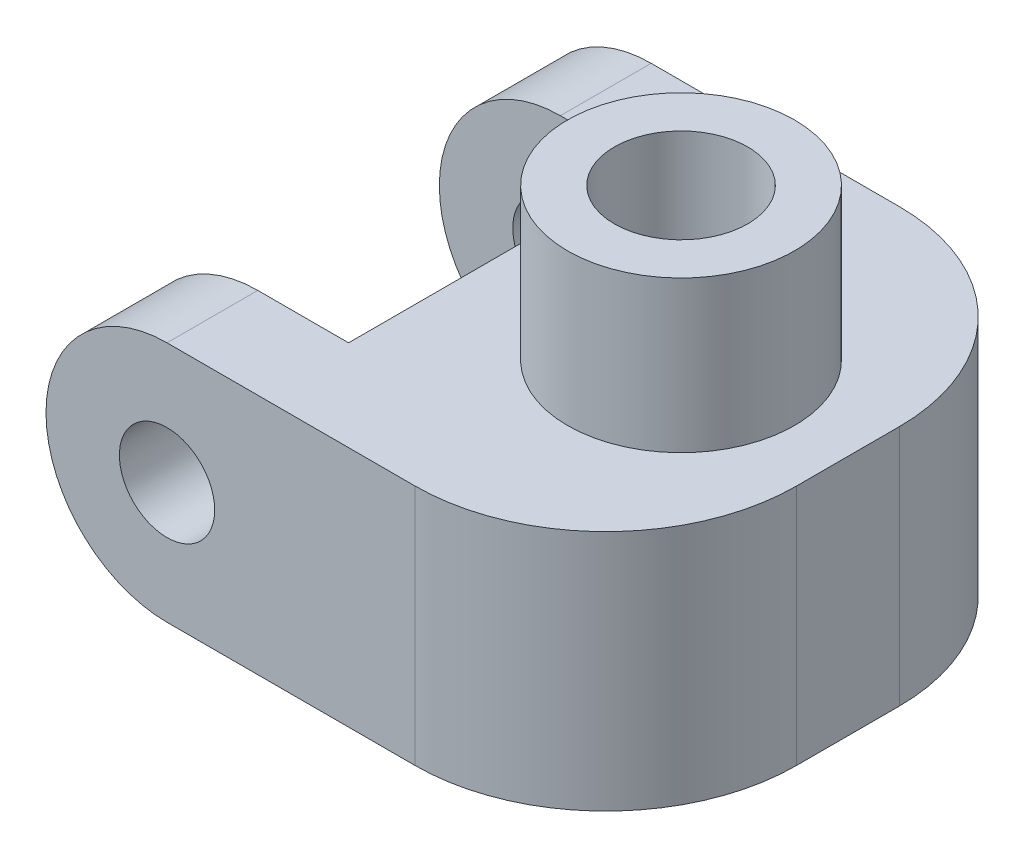
ISO-10303-21;
HEADER;
FILE_DESCRIPTION(('STEP AP214'),'2;1');
FILE_NAME('part.step','',(''),(''),'','','');
FILE_SCHEMA(('AUTOMOTIVE_DESIGN { 1 0 10303 214 1 1 1 1 }'));
ENDSEC;
DATA;
#1=APPLICATION_CONTEXT('core data for automotive mechanical design processes');
#2=APPLICATION_PROTOCOL_DEFINITION('international standard','automotive_design',2000,#1);
#3=PRODUCT_CONTEXT('',#1,'mechanical');
#4=PRODUCT('Part','Part','',(#3));
#5=PRODUCT_RELATED_PRODUCT_CATEGORY('part','',(#4));
#6=PRODUCT_DEFINITION_FORMATION('','',#4);
#7=PRODUCT_DEFINITION_CONTEXT('part definition',#1,'design');
#8=PRODUCT_DEFINITION('design','',#6,#7);
#9=PRODUCT_DEFINITION_SHAPE('','',#8);
#10=(LENGTH_UNIT() NAMED_UNIT(*) SI_UNIT(.MILLI.,.METRE.));
#11=(NAMED_UNIT(*) PLANE_ANGLE_UNIT() SI_UNIT($,.RADIAN.));
#12=(NAMED_UNIT(*) SI_UNIT($,.STERADIAN.) SOLID_ANGLE_UNIT());
#13=UNCERTAINTY_MEASURE_WITH_UNIT(LENGTH_MEASURE(1.E-05),#10,'distance_accuracy_value','');
#14=(GEOMETRIC_REPRESENTATION_CONTEXT(3) GLOBAL_UNCERTAINTY_ASSIGNED_CONTEXT((#13)) GLOBAL_UNIT_ASSIGNED_CONTEXT((#10,
#11,#12)) REPRESENTATION_CONTEXT('',''));
#15=CARTESIAN_POINT('',(0.,0.,0.));
#16=DIRECTION('',(0.,0.,1.));
#17=DIRECTION('',(1.,0.,0.));
#18=AXIS2_PLACEMENT_3D('',#15,#16,#17);
#19=CARTESIAN_POINT('',(0.,-5.08,20.32));
#20=DIRECTION('',(0.,-1.,0.));
#21=DIRECTION('',(0.,0.,-1.));
#22=AXIS2_PLACEMENT_3D('',#19,#20,#21);
#23=PLANE('',#22);
#24=DIRECTION('',(0.,0.,-1.));
#25=VECTOR('',#24,1.);
#26=CARTESIAN_POINT('',(18.415,-5.08,20.32));
#27=LINE('',#26,#25);
#28=CARTESIAN_POINT('',(18.415,-5.08,12.32));
#29=VERTEX_POINT('',#28);
#30=CARTESIAN_POINT('',(18.415,-5.08,8.));
#31=VERTEX_POINT('',#30);
#32=EDGE_CURVE('E188',#29,#31,#27,.T.);
#33=ORIENTED_EDGE('',*,*,#32,.F.);
#34=CARTESIAN_POINT('',(10.415,-5.08,12.32));
#35=DIRECTION('',(0.,-1.,0.));
#36=DIRECTION('',(0.,0.,-1.));
#37=AXIS2_PLACEMENT_3D('',#34,#35,#36);
#38=CIRCLE('',#37,8.);
#39=CARTESIAN_POINT('',(10.415,-5.08,20.32));
#40=VERTEX_POINT('',#39);
#41=EDGE_CURVE('E51',#29,#40,#38,.T.);
#42=ORIENTED_EDGE('',*,*,#41,.T.);
#43=DIRECTION('',(-1.,0.,0.));
#44=VECTOR('',#43,1.);
#45=CARTESIAN_POINT('',(0.,-5.08,20.32));
#46=LINE('',#45,#44);
#47=CARTESIAN_POINT('',(0.,-5.08,20.32));
#48=VERTEX_POINT('',#47);
#49=EDGE_CURVE('E173',#40,#48,#46,.T.);
#50=ORIENTED_EDGE('',*,*,#49,.T.);
#51=DIRECTION('',(0.,0.,-1.));
#52=VECTOR('',#51,1.);
#53=CARTESIAN_POINT('',(0.,-5.08,20.32));
#54=LINE('',#53,#52);
#55=CARTESIAN_POINT('',(0.,-5.08,16.51));
#56=VERTEX_POINT('',#55);
#57=EDGE_CURVE('E195',#48,#56,#54,.T.);
#58=ORIENTED_EDGE('',*,*,#57,.T.);
#59=DIRECTION('',(-1.,0.,0.));
#60=VECTOR('',#59,1.);
#61=CARTESIAN_POINT('',(0.,-5.08,16.51));
#62=LINE('',#61,#60);
#63=CARTESIAN_POINT('',(11.4300000000001,-5.08,16.51));
#64=VERTEX_POINT('',#63);
#65=EDGE_CURVE('E171',#64,#56,#62,.T.);
#66=ORIENTED_EDGE('',*,*,#65,.F.);
#67=DIRECTION('',(0.,0.,-1.));
#68=VECTOR('',#67,1.);
#69=CARTESIAN_POINT('',(11.4300000000001,-5.08,20.32));
#70=LINE('',#69,#68);
#71=CARTESIAN_POINT('',(11.4300000000001,-5.08,3.81));
#72=VERTEX_POINT('',#71);
#73=EDGE_CURVE('E206',#64,#72,#70,.T.);
#74=ORIENTED_EDGE('',*,*,#73,.T.);
#75=DIRECTION('',(-1.,0.,0.));
#76=VECTOR('',#75,1.);
#77=CARTESIAN_POINT('',(0.,-5.08,3.81));
#78=LINE('',#77,#76);
#79=CARTESIAN_POINT('',(0.,-5.08,3.81));
#80=VERTEX_POINT('',#79);
#81=EDGE_CURVE('E139',#72,#80,#78,.T.);
#82=ORIENTED_EDGE('',*,*,#81,.T.);
#83=CARTESIAN_POINT('',(0.,-5.08,0.));
#84=VERTEX_POINT('',#83);
#85=EDGE_CURVE('E184',#80,#84,#54,.T.);
#86=ORIENTED_EDGE('',*,*,#85,.T.);
#87=DIRECTION('',(-1.,0.,0.));
#88=VECTOR('',#87,1.);
#89=CARTESIAN_POINT('',(0.,-5.08,0.));
#90=LINE('',#89,#88);
#91=CARTESIAN_POINT('',(10.415,-5.08,0.));
#92=VERTEX_POINT('',#91);
#93=EDGE_CURVE('E185',#92,#84,#90,.T.);
#94=ORIENTED_EDGE('',*,*,#93,.F.);
#95=CARTESIAN_POINT('',(10.415,-5.08,8.));
#96=DIRECTION('',(0.,-1.,0.));
#97=DIRECTION('',(0.,0.,-1.));
#98=AXIS2_PLACEMENT_3D('',#95,#96,#97);
#99=CIRCLE('',#98,8.);
#100=EDGE_CURVE('E63',#92,#31,#99,.T.);
#101=ORIENTED_EDGE('',*,*,#100,.T.);
#102=EDGE_LOOP('',(#33,#42,#50,#58,#66,#74,#82,#86,#94,#101));
#103=FACE_BOUND('',#102,.T.);
#104=ADVANCED_FACE('F43',(#103),#23,.T.);
#105=CARTESIAN_POINT('',(0.,5.08,20.32));
#106=DIRECTION('',(0.,1.,0.));
#107=DIRECTION('',(0.,0.,1.));
#108=AXIS2_PLACEMENT_3D('',#105,#106,#107);
#109=PLANE('',#108);
#110=CARTESIAN_POINT('',(11.415,5.08,10.16));
#111=DIRECTION('',(0.,1.,0.));
#112=DIRECTION('',(0.,0.,1.));
#113=AXIS2_PLACEMENT_3D('',#110,#111,#112);
#114=CIRCLE('',#113,4.76250000000001);
#115=CARTESIAN_POINT('',(11.415,5.08,14.9225));
#116=VERTEX_POINT('',#115);
#117=EDGE_CURVE('E486',#116,#116,#114,.T.);
#118=ORIENTED_EDGE('',*,*,#117,.F.);
#119=EDGE_LOOP('',(#118));
#120=FACE_BOUND('',#119,.T.);
#121=DIRECTION('',(1.,0.,0.));
#122=VECTOR('',#121,1.);
#123=CARTESIAN_POINT('',(0.,5.08,20.32));
#124=LINE('',#123,#122);
#125=CARTESIAN_POINT('',(0.,5.08,20.32));
#126=VERTEX_POINT('',#125);
#127=CARTESIAN_POINT('',(10.415,5.08,20.32));
#128=VERTEX_POINT('',#127);
#129=EDGE_CURVE('E175',#126,#128,#124,.T.);
#130=ORIENTED_EDGE('',*,*,#129,.T.);
#131=CARTESIAN_POINT('',(10.415,5.08,12.32));
#132=DIRECTION('',(0.,1.,0.));
#133=DIRECTION('',(0.,0.,1.));
#134=AXIS2_PLACEMENT_3D('',#131,#132,#133);
#135=CIRCLE('',#134,8.);
#136=CARTESIAN_POINT('',(18.415,5.08,12.32));
#137=VERTEX_POINT('',#136);
#138=EDGE_CURVE('E218',#128,#137,#135,.T.);
#139=ORIENTED_EDGE('',*,*,#138,.T.);
#140=DIRECTION('',(0.,0.,-1.));
#141=VECTOR('',#140,1.);
#142=CARTESIAN_POINT('',(18.415,5.08,20.32));
#143=LINE('',#142,#141);
#144=CARTESIAN_POINT('',(18.415,5.08,8.));
#145=VERTEX_POINT('',#144);
#146=EDGE_CURVE('E138',#137,#145,#143,.T.);
#147=ORIENTED_EDGE('',*,*,#146,.T.);
#148=CARTESIAN_POINT('',(10.415,5.08,8.));
#149=DIRECTION('',(0.,1.,0.));
#150=DIRECTION('',(0.,0.,1.));
#151=AXIS2_PLACEMENT_3D('',#148,#149,#150);
#152=CIRCLE('',#151,8.);
#153=CARTESIAN_POINT('',(10.415,5.08,0.));
#154=VERTEX_POINT('',#153);
#155=EDGE_CURVE('E216',#145,#154,#152,.T.);
#156=ORIENTED_EDGE('',*,*,#155,.T.);
#157=DIRECTION('',(1.,0.,0.));
#158=VECTOR('',#157,1.);
#159=CARTESIAN_POINT('',(0.,5.08,0.));
#160=LINE('',#159,#158);
#161=CARTESIAN_POINT('',(0.,5.08,0.));
#162=VERTEX_POINT('',#161);
#163=EDGE_CURVE('E187',#162,#154,#160,.T.);
#164=ORIENTED_EDGE('',*,*,#163,.F.);
#165=DIRECTION('',(0.,0.,-1.));
#166=VECTOR('',#165,1.);
#167=CARTESIAN_POINT('',(0.,5.08,20.32));
#168=LINE('',#167,#166);
#169=CARTESIAN_POINT('',(0.,5.08,3.81));
#170=VERTEX_POINT('',#169);
#171=EDGE_CURVE('E153',#170,#162,#168,.T.);
#172=ORIENTED_EDGE('',*,*,#171,.F.);
#173=DIRECTION('',(1.,0.,0.));
#174=VECTOR('',#173,1.);
#175=CARTESIAN_POINT('',(0.,5.08,3.81));
#176=LINE('',#175,#174);
#177=CARTESIAN_POINT('',(3.81,5.08,3.81));
#178=VERTEX_POINT('',#177);
#179=EDGE_CURVE('E143',#170,#178,#176,.T.);
#180=ORIENTED_EDGE('',*,*,#179,.T.);
#181=DIRECTION('',(0.,0.,1.));
#182=VECTOR('',#181,1.);
#183=CARTESIAN_POINT('',(3.81,5.08,3.81));
#184=LINE('',#183,#182);
#185=CARTESIAN_POINT('',(3.81,5.08,16.51));
#186=VERTEX_POINT('',#185);
#187=EDGE_CURVE('E127',#178,#186,#184,.T.);
#188=ORIENTED_EDGE('',*,*,#187,.T.);
#189=DIRECTION('',(1.,0.,0.));
#190=VECTOR('',#189,1.);
#191=CARTESIAN_POINT('',(0.,5.08,16.51));
#192=LINE('',#191,#190);
#193=CARTESIAN_POINT('',(0.,5.08,16.51));
#194=VERTEX_POINT('',#193);
#195=EDGE_CURVE('E166',#194,#186,#192,.T.);
#196=ORIENTED_EDGE('',*,*,#195,.F.);
#197=EDGE_CURVE('E198',#126,#194,#168,.T.);
#198=ORIENTED_EDGE('',*,*,#197,.F.);
#199=EDGE_LOOP('',(#130,#139,#147,#156,#164,#172,#180,#188,#196,#198));
#200=FACE_BOUND('',#199,.T.);
#201=ADVANCED_FACE('F151',(#120,#200),#109,.T.);
#202=CARTESIAN_POINT('',(0.,0.,20.32));
#203=DIRECTION('',(0.,0.,-1.));
#204=DIRECTION('',(-1.,0.,0.));
#205=AXIS2_PLACEMENT_3D('',#202,#203,#204);
#206=CYLINDRICAL_SURFACE('',#205,5.08);
#207=CARTESIAN_POINT('',(0.,0.,3.81));
#208=DIRECTION('',(0.,0.,1.));
#209=DIRECTION('',(1.,0.,0.));
#210=AXIS2_PLACEMENT_3D('',#207,#208,#209);
#211=CIRCLE('',#210,5.08);
#212=EDGE_CURVE('E154',#170,#80,#211,.T.);
#213=ORIENTED_EDGE('',*,*,#212,.F.);
#214=ORIENTED_EDGE('',*,*,#171,.T.);
#215=CARTESIAN_POINT('',(0.,0.,0.));
#216=DIRECTION('',(0.,0.,1.));
#217=DIRECTION('',(1.,0.,0.));
#218=AXIS2_PLACEMENT_3D('',#215,#216,#217);
#219=CIRCLE('',#218,5.08);
#220=EDGE_CURVE('E190',#162,#84,#219,.T.);
#221=ORIENTED_EDGE('',*,*,#220,.T.);
#222=ORIENTED_EDGE('',*,*,#85,.F.);
#223=EDGE_LOOP('',(#213,#214,#221,#222));
#224=FACE_BOUND('',#223,.T.);
#225=ADVANCED_FACE('F248',(#224),#206,.T.);
#226=CARTESIAN_POINT('',(0.,0.,20.32));
#227=DIRECTION('',(0.,0.,-1.));
#228=DIRECTION('',(-1.,0.,0.));
#229=AXIS2_PLACEMENT_3D('',#226,#227,#228);
#230=CYLINDRICAL_SURFACE('',#229,2.);
#231=CARTESIAN_POINT('',(0.,0.,0.));
#232=DIRECTION('',(0.,0.,1.));
#233=DIRECTION('',(1.,0.,0.));
#234=AXIS2_PLACEMENT_3D('',#231,#232,#233);
#235=CIRCLE('',#234,2.);
#236=CARTESIAN_POINT('',(2.,0.,0.));
#237=VERTEX_POINT('',#236);
#238=EDGE_CURVE('E176',#237,#237,#235,.T.);
#239=ORIENTED_EDGE('',*,*,#238,.F.);
#240=EDGE_LOOP('',(#239));
#241=FACE_BOUND('',#240,.T.);
#242=CARTESIAN_POINT('',(0.,0.,3.81));
#243=DIRECTION('',(0.,0.,1.));
#244=DIRECTION('',(1.,0.,0.));
#245=AXIS2_PLACEMENT_3D('',#242,#243,#244);
#246=CIRCLE('',#245,2.);
#247=CARTESIAN_POINT('',(2.,0.,3.81));
#248=VERTEX_POINT('',#247);
#249=EDGE_CURVE('E147',#248,#248,#246,.T.);
#250=ORIENTED_EDGE('',*,*,#249,.T.);
#251=EDGE_LOOP('',(#250));
#252=FACE_BOUND('',#251,.T.);
#253=ADVANCED_FACE('F258',(#241,#252),#230,.F.);
#254=ORIENTED_EDGE('',*,*,#197,.T.);
#255=CARTESIAN_POINT('',(0.,0.,16.51));
#256=DIRECTION('',(0.,0.,1.));
#257=DIRECTION('',(1.,0.,0.));
#258=AXIS2_PLACEMENT_3D('',#255,#256,#257);
#259=CIRCLE('',#258,5.08);
#260=EDGE_CURVE('E168',#194,#56,#259,.T.);
#261=ORIENTED_EDGE('',*,*,#260,.T.);
#262=ORIENTED_EDGE('',*,*,#57,.F.);
#263=CARTESIAN_POINT('',(0.,0.,20.32));
#264=DIRECTION('',(0.,0.,1.));
#265=DIRECTION('',(1.,0.,0.));
#266=AXIS2_PLACEMENT_3D('',#263,#264,#265);
#267=CIRCLE('',#266,5.08);
#268=EDGE_CURVE('E178',#126,#48,#267,.T.);
#269=ORIENTED_EDGE('',*,*,#268,.F.);
#270=EDGE_LOOP('',(#254,#261,#262,#269));
#271=FACE_BOUND('',#270,.T.);
#272=ADVANCED_FACE('F255',(#271),#206,.T.);
#273=CARTESIAN_POINT('',(0.,0.,16.51));
#274=DIRECTION('',(0.,0.,1.));
#275=DIRECTION('',(1.,0.,0.));
#276=AXIS2_PLACEMENT_3D('',#273,#274,#275);
#277=CIRCLE('',#276,2.);
#278=CARTESIAN_POINT('',(2.,0.,16.51));
#279=VERTEX_POINT('',#278);
#280=EDGE_CURVE('E161',#279,#279,#277,.T.);
#281=ORIENTED_EDGE('',*,*,#280,.F.);
#282=EDGE_LOOP('',(#281));
#283=FACE_BOUND('',#282,.T.);
#284=CARTESIAN_POINT('',(0.,0.,20.32));
#285=DIRECTION('',(0.,0.,1.));
#286=DIRECTION('',(1.,0.,0.));
#287=AXIS2_PLACEMENT_3D('',#284,#285,#286);
#288=CIRCLE('',#287,2.);
#289=CARTESIAN_POINT('',(2.,0.,20.32));
#290=VERTEX_POINT('',#289);
#291=EDGE_CURVE('E181',#290,#290,#288,.T.);
#292=ORIENTED_EDGE('',*,*,#291,.T.);
#293=EDGE_LOOP('',(#292));
#294=FACE_BOUND('',#293,.T.);
#295=ADVANCED_FACE('F257',(#283,#294),#230,.F.);
#296=CARTESIAN_POINT('',(0.,0.,20.32));
#297=DIRECTION('',(0.,0.,1.));
#298=DIRECTION('',(1.,0.,0.));
#299=AXIS2_PLACEMENT_3D('',#296,#297,#298);
#300=PLANE('',#299);
#301=ORIENTED_EDGE('',*,*,#49,.F.);
#302=DIRECTION('',(0.,1.,0.));
#303=VECTOR('',#302,1.);
#304=CARTESIAN_POINT('',(10.415,5.08,20.32));
#305=LINE('',#304,#303);
#306=EDGE_CURVE('E213',#40,#128,#305,.T.);
#307=ORIENTED_EDGE('',*,*,#306,.T.);
#308=ORIENTED_EDGE('',*,*,#129,.F.);
#309=ORIENTED_EDGE('',*,*,#268,.T.);
#310=EDGE_LOOP('',(#301,#307,#308,#309));
#311=FACE_BOUND('',#310,.T.);
#312=ORIENTED_EDGE('',*,*,#291,.F.);
#313=EDGE_LOOP('',(#312));
#314=FACE_BOUND('',#313,.T.);
#315=ADVANCED_FACE('F231',(#311,#314),#300,.T.);
#316=CARTESIAN_POINT('',(0.,0.,0.));
#317=DIRECTION('',(0.,0.,1.));
#318=DIRECTION('',(1.,0.,0.));
#319=AXIS2_PLACEMENT_3D('',#316,#317,#318);
#320=PLANE('',#319);
#321=ORIENTED_EDGE('',*,*,#163,.T.);
#322=DIRECTION('',(0.,1.,0.));
#323=VECTOR('',#322,1.);
#324=CARTESIAN_POINT('',(10.415,0.,0.));
#325=LINE('',#324,#323);
#326=EDGE_CURVE('E11',#154,#92,#325,.F.);
#327=ORIENTED_EDGE('',*,*,#326,.T.);
#328=ORIENTED_EDGE('',*,*,#93,.T.);
#329=ORIENTED_EDGE('',*,*,#220,.F.);
#330=EDGE_LOOP('',(#321,#327,#328,#329));
#331=FACE_BOUND('',#330,.T.);
#332=ORIENTED_EDGE('',*,*,#238,.T.);
#333=EDGE_LOOP('',(#332));
#334=FACE_BOUND('',#333,.T.);
#335=ADVANCED_FACE('F243',(#331,#334),#320,.F.);
#336=CARTESIAN_POINT('',(18.415,-5.08,20.32));
#337=DIRECTION('',(-1.,0.,0.));
#338=DIRECTION('',(0.,0.,1.));
#339=AXIS2_PLACEMENT_3D('',#336,#337,#338);
#340=PLANE('',#339);
#341=ORIENTED_EDGE('',*,*,#146,.F.);
#342=DIRECTION('',(0.,1.,0.));
#343=VECTOR('',#342,1.);
#344=CARTESIAN_POINT('',(18.415,-5.08,12.32));
#345=LINE('',#344,#343);
#346=EDGE_CURVE('E223',#137,#29,#345,.F.);
#347=ORIENTED_EDGE('',*,*,#346,.T.);
#348=ORIENTED_EDGE('',*,*,#32,.T.);
#349=DIRECTION('',(0.,1.,0.));
#350=VECTOR('',#349,1.);
#351=CARTESIAN_POINT('',(18.415,-5.08,8.));
#352=LINE('',#351,#350);
#353=EDGE_CURVE('E220',#31,#145,#352,.T.);
#354=ORIENTED_EDGE('',*,*,#353,.T.);
#355=EDGE_LOOP('',(#341,#347,#348,#354));
#356=FACE_BOUND('',#355,.T.);
#357=ADVANCED_FACE('F239',(#356),#340,.F.);
#358=CARTESIAN_POINT('',(3.81,0.,3.81));
#359=DIRECTION('',(-1.,0.,0.));
#360=DIRECTION('',(0.,0.,1.));
#361=AXIS2_PLACEMENT_3D('',#358,#359,#360);
#362=PLANE('',#361);
#363=DIRECTION('',(0.,-1.,0.));
#364=VECTOR('',#363,1.);
#365=CARTESIAN_POINT('',(3.81,0.,3.81));
#366=LINE('',#365,#364);
#367=CARTESIAN_POINT('',(3.81,-0.680590948775045,3.81));
#368=VERTEX_POINT('',#367);
#369=EDGE_CURVE('E131',#178,#368,#366,.T.);
#370=ORIENTED_EDGE('',*,*,#369,.T.);
#371=DIRECTION('',(0.,0.,1.));
#372=VECTOR('',#371,1.);
#373=CARTESIAN_POINT('',(3.81,-0.680590948775045,3.81));
#374=LINE('',#373,#372);
#375=CARTESIAN_POINT('',(3.81,-0.680590948775045,16.51));
#376=VERTEX_POINT('',#375);
#377=EDGE_CURVE('E201',#368,#376,#374,.T.);
#378=ORIENTED_EDGE('',*,*,#377,.T.);
#379=DIRECTION('',(0.,-1.,0.));
#380=VECTOR('',#379,1.);
#381=CARTESIAN_POINT('',(3.81,0.,16.51));
#382=LINE('',#381,#380);
#383=EDGE_CURVE('E134',#186,#376,#382,.T.);
#384=ORIENTED_EDGE('',*,*,#383,.F.);
#385=ORIENTED_EDGE('',*,*,#187,.F.);
#386=EDGE_LOOP('',(#370,#378,#384,#385));
#387=FACE_BOUND('',#386,.T.);
#388=ADVANCED_FACE('F129',(#387),#362,.T.);
#389=CARTESIAN_POINT('',(0.,0.,3.81));
#390=DIRECTION('',(0.,0.,1.));
#391=DIRECTION('',(1.,0.,0.));
#392=AXIS2_PLACEMENT_3D('',#389,#390,#391);
#393=PLANE('',#392);
#394=ORIENTED_EDGE('',*,*,#249,.F.);
#395=EDGE_LOOP('',(#394));
#396=FACE_BOUND('',#395,.T.);
#397=ORIENTED_EDGE('',*,*,#369,.F.);
#398=ORIENTED_EDGE('',*,*,#179,.F.);
#399=ORIENTED_EDGE('',*,*,#212,.T.);
#400=ORIENTED_EDGE('',*,*,#81,.F.);
#401=DIRECTION('',(0.86602540378444,-0.499999999999998,0.));
#402=VECTOR('',#401,1.);
#403=CARTESIAN_POINT('',(3.81,-0.680590948775045,3.81));
#404=LINE('',#403,#402);
#405=EDGE_CURVE('E146',#72,#368,#404,.F.);
#406=ORIENTED_EDGE('',*,*,#405,.T.);
#407=EDGE_LOOP('',(#397,#398,#399,#400,#406));
#408=FACE_BOUND('',#407,.T.);
#409=ADVANCED_FACE('F142',(#396,#408),#393,.T.);
#410=CARTESIAN_POINT('',(0.,0.,16.51));
#411=DIRECTION('',(0.,0.,1.));
#412=DIRECTION('',(1.,0.,0.));
#413=AXIS2_PLACEMENT_3D('',#410,#411,#412);
#414=PLANE('',#413);
#415=ORIENTED_EDGE('',*,*,#280,.T.);
#416=EDGE_LOOP('',(#415));
#417=FACE_BOUND('',#416,.T.);
#418=ORIENTED_EDGE('',*,*,#383,.T.);
#419=DIRECTION('',(-0.86602540378444,0.499999999999998,0.));
#420=VECTOR('',#419,1.);
#421=CARTESIAN_POINT('',(0.657795474387522,1.13933518262807,16.51));
#422=LINE('',#421,#420);
#423=EDGE_CURVE('E209',#376,#64,#422,.F.);
#424=ORIENTED_EDGE('',*,*,#423,.T.);
#425=ORIENTED_EDGE('',*,*,#65,.T.);
#426=ORIENTED_EDGE('',*,*,#260,.F.);
#427=ORIENTED_EDGE('',*,*,#195,.T.);
#428=EDGE_LOOP('',(#418,#424,#425,#426,#427));
#429=FACE_BOUND('',#428,.T.);
#430=ADVANCED_FACE('F253',(#417,#429),#414,.F.);
#431=CARTESIAN_POINT('',(11.415,11.43,10.16));
#432=DIRECTION('',(0.,-1.,0.));
#433=DIRECTION('',(0.,0.,-1.));
#434=AXIS2_PLACEMENT_3D('',#431,#432,#433);
#435=CYLINDRICAL_SURFACE('',#434,4.76250000000001);
#436=CARTESIAN_POINT('',(11.415,11.43,10.16));
#437=DIRECTION('',(0.,1.,0.));
#438=DIRECTION('',(0.,0.,1.));
#439=AXIS2_PLACEMENT_3D('',#436,#437,#438);
#440=CIRCLE('',#439,4.76250000000001);
#441=CARTESIAN_POINT('',(11.415,11.43,14.9225));
#442=VERTEX_POINT('',#441);
#443=EDGE_CURVE('E164',#442,#442,#440,.T.);
#444=ORIENTED_EDGE('',*,*,#443,.F.);
#445=EDGE_LOOP('',(#444));
#446=FACE_BOUND('',#445,.T.);
#447=ORIENTED_EDGE('',*,*,#117,.T.);
#448=EDGE_LOOP('',(#447));
#449=FACE_BOUND('',#448,.T.);
#450=ADVANCED_FACE('F331',(#446,#449),#435,.T.);
#451=CARTESIAN_POINT('',(11.415,11.43,10.16));
#452=DIRECTION('',(0.,1.,0.));
#453=DIRECTION('',(0.,0.,1.));
#454=AXIS2_PLACEMENT_3D('',#451,#452,#453);
#455=PLANE('',#454);
#456=CARTESIAN_POINT('',(11.415,11.43,10.16));
#457=DIRECTION('',(0.,1.,0.));
#458=DIRECTION('',(0.,0.,1.));
#459=AXIS2_PLACEMENT_3D('',#456,#457,#458);
#460=CIRCLE('',#459,2.8);
#461=CARTESIAN_POINT('',(11.415,11.43,12.96));
#462=VERTEX_POINT('',#461);
#463=EDGE_CURVE('E492',#462,#462,#460,.T.);
#464=ORIENTED_EDGE('',*,*,#463,.F.);
#465=EDGE_LOOP('',(#464));
#466=FACE_BOUND('',#465,.T.);
#467=ORIENTED_EDGE('',*,*,#443,.T.);
#468=EDGE_LOOP('',(#467));
#469=FACE_BOUND('',#468,.T.);
#470=ADVANCED_FACE('F321',(#466,#469),#455,.T.);
#471=CARTESIAN_POINT('',(11.415,6.43,10.16));
#472=DIRECTION('',(0.,1.,0.));
#473=DIRECTION('',(0.,0.,1.));
#474=AXIS2_PLACEMENT_3D('',#471,#472,#473);
#475=CYLINDRICAL_SURFACE('',#474,2.8);
#476=CARTESIAN_POINT('',(11.415,6.43,10.16));
#477=DIRECTION('',(0.,1.,0.));
#478=DIRECTION('',(0.,0.,1.));
#479=AXIS2_PLACEMENT_3D('',#476,#477,#478);
#480=CIRCLE('',#479,2.8);
#481=CARTESIAN_POINT('',(11.415,6.43,12.96));
#482=VERTEX_POINT('',#481);
#483=EDGE_CURVE('E489',#482,#482,#480,.T.);
#484=ORIENTED_EDGE('',*,*,#483,.F.);
#485=EDGE_LOOP('',(#484));
#486=FACE_BOUND('',#485,.T.);
#487=ORIENTED_EDGE('',*,*,#463,.T.);
#488=EDGE_LOOP('',(#487));
#489=FACE_BOUND('',#488,.T.);
#490=ADVANCED_FACE('F310',(#486,#489),#475,.F.);
#491=CARTESIAN_POINT('',(0.,6.43,0.));
#492=DIRECTION('',(0.,1.,0.));
#493=DIRECTION('',(0.,0.,1.));
#494=AXIS2_PLACEMENT_3D('',#491,#492,#493);
#495=PLANE('',#494);
#496=ORIENTED_EDGE('',*,*,#483,.T.);
#497=EDGE_LOOP('',(#496));
#498=FACE_BOUND('',#497,.T.);
#499=ADVANCED_FACE('F282',(#498),#495,.T.);
#500=CARTESIAN_POINT('',(3.81,-0.680590948775045,3.81));
#501=DIRECTION('',(0.499999999999998,0.86602540378444,0.));
#502=DIRECTION('',(0.,0.,1.));
#503=AXIS2_PLACEMENT_3D('',#500,#501,#502);
#504=PLANE('',#503);
#505=ORIENTED_EDGE('',*,*,#405,.F.);
#506=ORIENTED_EDGE('',*,*,#73,.F.);
#507=ORIENTED_EDGE('',*,*,#423,.F.);
#508=ORIENTED_EDGE('',*,*,#377,.F.);
#509=EDGE_LOOP('',(#505,#506,#507,#508));
#510=FACE_BOUND('',#509,.T.);
#511=ADVANCED_FACE('F251',(#510),#504,.F.);
#512=CARTESIAN_POINT('',(10.415,0.,12.32));
#513=DIRECTION('',(0.,-1.,0.));
#514=DIRECTION('',(0.,0.,-1.));
#515=AXIS2_PLACEMENT_3D('',#512,#513,#514);
#516=CYLINDRICAL_SURFACE('',#515,8.);
#517=ORIENTED_EDGE('',*,*,#41,.F.);
#518=ORIENTED_EDGE('',*,*,#346,.F.);
#519=ORIENTED_EDGE('',*,*,#138,.F.);
#520=ORIENTED_EDGE('',*,*,#306,.F.);
#521=EDGE_LOOP('',(#517,#518,#519,#520));
#522=FACE_BOUND('',#521,.T.);
#523=ADVANCED_FACE('F236',(#522),#516,.T.);
#524=CARTESIAN_POINT('',(10.415,-5.08,8.));
#525=DIRECTION('',(0.,1.,0.));
#526=DIRECTION('',(0.,0.,1.));
#527=AXIS2_PLACEMENT_3D('',#524,#525,#526);
#528=CYLINDRICAL_SURFACE('',#527,8.);
#529=ORIENTED_EDGE('',*,*,#100,.F.);
#530=ORIENTED_EDGE('',*,*,#326,.F.);
#531=ORIENTED_EDGE('',*,*,#155,.F.);
#532=ORIENTED_EDGE('',*,*,#353,.F.);
#533=EDGE_LOOP('',(#529,#530,#531,#532));
#534=FACE_BOUND('',#533,.T.);
#535=ADVANCED_FACE('F45',(#534),#528,.T.);
#536=CLOSED_SHELL('',(#104,#201,#225,#253,#272,#295,#315,#335,#357,#388,#409,#430,#450,#470,
#490,#499,#511,#523,#535));
#537=MANIFOLD_SOLID_BREP('B2',#536);
#538=ADVANCED_BREP_SHAPE_REPRESENTATION('',(#18,#537),#14);
#539=SHAPE_DEFINITION_REPRESENTATION(#9,#538);
ENDSEC;
END-ISO-10303-21;
